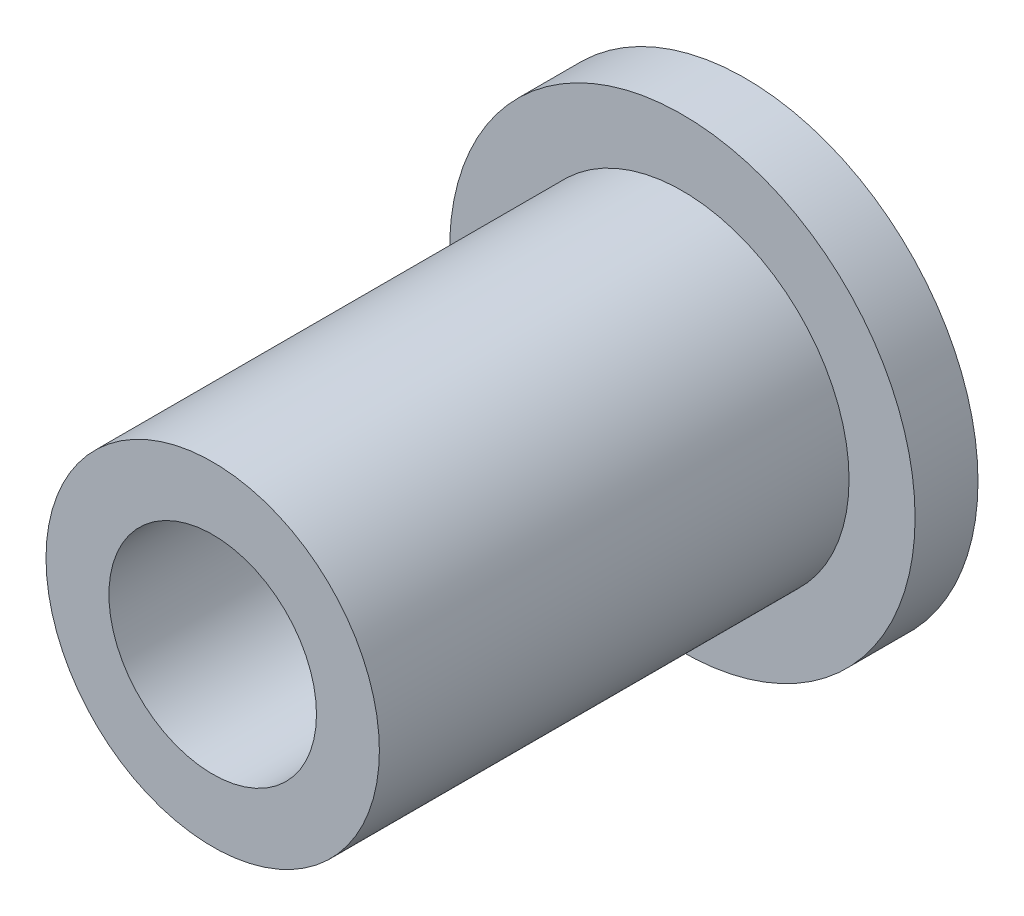
ISO-10303-21;
HEADER;
FILE_DESCRIPTION(('STEP AP214'),'2;1');
FILE_NAME('part.step','',(''),(''),'','','');
FILE_SCHEMA(('AUTOMOTIVE_DESIGN { 1 0 10303 214 1 1 1 1 }'));
ENDSEC;
DATA;
#1=APPLICATION_CONTEXT('core data for automotive mechanical design processes');
#2=APPLICATION_PROTOCOL_DEFINITION('international standard','automotive_design',2000,#1);
#3=PRODUCT_CONTEXT('',#1,'mechanical');
#4=PRODUCT('Part','Part','',(#3));
#5=PRODUCT_RELATED_PRODUCT_CATEGORY('part','',(#4));
#6=PRODUCT_DEFINITION_FORMATION('','',#4);
#7=PRODUCT_DEFINITION_CONTEXT('part definition',#1,'design');
#8=PRODUCT_DEFINITION('design','',#6,#7);
#9=PRODUCT_DEFINITION_SHAPE('','',#8);
#10=(LENGTH_UNIT() NAMED_UNIT(*) SI_UNIT(.MILLI.,.METRE.));
#11=(NAMED_UNIT(*) PLANE_ANGLE_UNIT() SI_UNIT($,.RADIAN.));
#12=(NAMED_UNIT(*) SI_UNIT($,.STERADIAN.) SOLID_ANGLE_UNIT());
#13=UNCERTAINTY_MEASURE_WITH_UNIT(LENGTH_MEASURE(1.E-05),#10,'distance_accuracy_value','');
#14=(GEOMETRIC_REPRESENTATION_CONTEXT(3) GLOBAL_UNCERTAINTY_ASSIGNED_CONTEXT((#13)) GLOBAL_UNIT_ASSIGNED_CONTEXT((#10,
#11,#12)) REPRESENTATION_CONTEXT('',''));
#15=CARTESIAN_POINT('',(0.,0.,0.));
#16=DIRECTION('',(0.,0.,1.));
#17=DIRECTION('',(1.,0.,0.));
#18=AXIS2_PLACEMENT_3D('',#15,#16,#17);
#19=CARTESIAN_POINT('',(0.,0.,-1.5));
#20=DIRECTION('',(0.,0.,1.));
#21=DIRECTION('',(1.,0.,0.));
#22=AXIS2_PLACEMENT_3D('',#19,#20,#21);
#23=PLANE('',#22);
#24=CARTESIAN_POINT('',(0.,0.,-1.5));
#25=DIRECTION('',(0.,0.,1.));
#26=DIRECTION('',(1.,0.,0.));
#27=AXIS2_PLACEMENT_3D('',#24,#25,#26);
#28=CIRCLE('',#27,5.55);
#29=CARTESIAN_POINT('',(5.55,0.,-1.5));
#30=VERTEX_POINT('',#29);
#31=EDGE_CURVE('E10',#30,#30,#28,.T.);
#32=ORIENTED_EDGE('',*,*,#31,.F.);
#33=EDGE_LOOP('',(#32));
#34=FACE_BOUND('',#33,.T.);
#35=CARTESIAN_POINT('',(0.,0.,-1.5));
#36=DIRECTION('',(0.,0.,1.));
#37=DIRECTION('',(1.,0.,0.));
#38=AXIS2_PLACEMENT_3D('',#35,#36,#37);
#39=CIRCLE('',#38,2.475);
#40=CARTESIAN_POINT('',(2.475,0.,-1.5));
#41=VERTEX_POINT('',#40);
#42=EDGE_CURVE('E57',#41,#41,#39,.T.);
#43=ORIENTED_EDGE('',*,*,#42,.T.);
#44=EDGE_LOOP('',(#43));
#45=FACE_BOUND('',#44,.T.);
#46=ADVANCED_FACE('F35',(#34,#45),#23,.F.);
#47=CARTESIAN_POINT('',(0.,0.,0.));
#48=DIRECTION('',(0.,0.,1.));
#49=DIRECTION('',(1.,0.,0.));
#50=AXIS2_PLACEMENT_3D('',#47,#48,#49);
#51=PLANE('',#50);
#52=CARTESIAN_POINT('',(0.,0.,0.));
#53=DIRECTION('',(0.,0.,1.));
#54=DIRECTION('',(1.,0.,0.));
#55=AXIS2_PLACEMENT_3D('',#52,#53,#54);
#56=CIRCLE('',#55,5.55);
#57=CARTESIAN_POINT('',(5.55,0.,0.));
#58=VERTEX_POINT('',#57);
#59=EDGE_CURVE('E39',#58,#58,#56,.T.);
#60=ORIENTED_EDGE('',*,*,#59,.T.);
#61=EDGE_LOOP('',(#60));
#62=FACE_BOUND('',#61,.T.);
#63=CARTESIAN_POINT('',(0.,0.,0.));
#64=DIRECTION('',(0.,0.,1.));
#65=DIRECTION('',(1.,0.,0.));
#66=AXIS2_PLACEMENT_3D('',#63,#64,#65);
#67=CIRCLE('',#66,3.975);
#68=CARTESIAN_POINT('',(3.975,0.,0.));
#69=VERTEX_POINT('',#68);
#70=EDGE_CURVE('E48',#69,#69,#67,.T.);
#71=ORIENTED_EDGE('',*,*,#70,.F.);
#72=EDGE_LOOP('',(#71));
#73=FACE_BOUND('',#72,.T.);
#74=ADVANCED_FACE('F81',(#62,#73),#51,.T.);
#75=CARTESIAN_POINT('',(0.,0.,-1.5));
#76=DIRECTION('',(0.,0.,1.));
#77=DIRECTION('',(1.,0.,0.));
#78=AXIS2_PLACEMENT_3D('',#75,#76,#77);
#79=CYLINDRICAL_SURFACE('',#78,5.55);
#80=ORIENTED_EDGE('',*,*,#31,.T.);
#81=EDGE_LOOP('',(#80));
#82=FACE_BOUND('',#81,.T.);
#83=ORIENTED_EDGE('',*,*,#59,.F.);
#84=EDGE_LOOP('',(#83));
#85=FACE_BOUND('',#84,.T.);
#86=ADVANCED_FACE('F37',(#82,#85),#79,.T.);
#87=CARTESIAN_POINT('',(0.,0.,11.2));
#88=DIRECTION('',(0.,0.,1.));
#89=DIRECTION('',(1.,0.,0.));
#90=AXIS2_PLACEMENT_3D('',#87,#88,#89);
#91=PLANE('',#90);
#92=CARTESIAN_POINT('',(0.,0.,11.2));
#93=DIRECTION('',(0.,0.,1.));
#94=DIRECTION('',(1.,0.,0.));
#95=AXIS2_PLACEMENT_3D('',#92,#93,#94);
#96=CIRCLE('',#95,3.975);
#97=CARTESIAN_POINT('',(3.975,0.,11.2));
#98=VERTEX_POINT('',#97);
#99=EDGE_CURVE('E46',#98,#98,#96,.T.);
#100=ORIENTED_EDGE('',*,*,#99,.T.);
#101=EDGE_LOOP('',(#100));
#102=FACE_BOUND('',#101,.T.);
#103=CARTESIAN_POINT('',(0.,0.,11.2));
#104=DIRECTION('',(0.,0.,1.));
#105=DIRECTION('',(1.,0.,0.));
#106=AXIS2_PLACEMENT_3D('',#103,#104,#105);
#107=CIRCLE('',#106,2.475);
#108=CARTESIAN_POINT('',(2.475,0.,11.2));
#109=VERTEX_POINT('',#108);
#110=EDGE_CURVE('E51',#109,#109,#107,.T.);
#111=ORIENTED_EDGE('',*,*,#110,.F.);
#112=EDGE_LOOP('',(#111));
#113=FACE_BOUND('',#112,.T.);
#114=ADVANCED_FACE('F76',(#102,#113),#91,.T.);
#115=CARTESIAN_POINT('',(0.,0.,11.2));
#116=DIRECTION('',(0.,0.,-1.));
#117=DIRECTION('',(-1.,0.,0.));
#118=AXIS2_PLACEMENT_3D('',#115,#116,#117);
#119=CYLINDRICAL_SURFACE('',#118,3.975);
#120=ORIENTED_EDGE('',*,*,#99,.F.);
#121=EDGE_LOOP('',(#120));
#122=FACE_BOUND('',#121,.T.);
#123=ORIENTED_EDGE('',*,*,#70,.T.);
#124=EDGE_LOOP('',(#123));
#125=FACE_BOUND('',#124,.T.);
#126=ADVANCED_FACE('F68',(#122,#125),#119,.T.);
#127=CARTESIAN_POINT('',(0.,0.,11.2));
#128=DIRECTION('',(0.,0.,-1.));
#129=DIRECTION('',(-1.,0.,0.));
#130=AXIS2_PLACEMENT_3D('',#127,#128,#129);
#131=CYLINDRICAL_SURFACE('',#130,2.475);
#132=ORIENTED_EDGE('',*,*,#110,.T.);
#133=EDGE_LOOP('',(#132));
#134=FACE_BOUND('',#133,.T.);
#135=CARTESIAN_POINT('',(0.,0.,0.));
#136=DIRECTION('',(0.,0.,1.));
#137=DIRECTION('',(1.,0.,0.));
#138=AXIS2_PLACEMENT_3D('',#135,#136,#137);
#139=CIRCLE('',#138,2.475);
#140=CARTESIAN_POINT('',(2.475,0.,0.));
#141=VERTEX_POINT('',#140);
#142=EDGE_CURVE('E56',#141,#141,#139,.T.);
#143=ORIENTED_EDGE('',*,*,#142,.F.);
#144=EDGE_LOOP('',(#143));
#145=FACE_BOUND('',#144,.T.);
#146=ADVANCED_FACE('F66',(#134,#145),#131,.F.);
#147=CARTESIAN_POINT('',(0.,0.,-1.5));
#148=DIRECTION('',(0.,0.,1.));
#149=DIRECTION('',(1.,0.,0.));
#150=AXIS2_PLACEMENT_3D('',#147,#148,#149);
#151=CYLINDRICAL_SURFACE('',#150,2.475);
#152=ORIENTED_EDGE('',*,*,#142,.T.);
#153=EDGE_LOOP('',(#152));
#154=FACE_BOUND('',#153,.T.);
#155=ORIENTED_EDGE('',*,*,#42,.F.);
#156=EDGE_LOOP('',(#155));
#157=FACE_BOUND('',#156,.T.);
#158=ADVANCED_FACE('F63',(#154,#157),#151,.F.);
#159=CLOSED_SHELL('',(#46,#74,#86,#114,#126,#146,#158));
#160=MANIFOLD_SOLID_BREP('B2',#159);
#161=ADVANCED_BREP_SHAPE_REPRESENTATION('',(#18,#160),#14);
#162=SHAPE_DEFINITION_REPRESENTATION(#9,#161);
ENDSEC;
END-ISO-10303-21;
